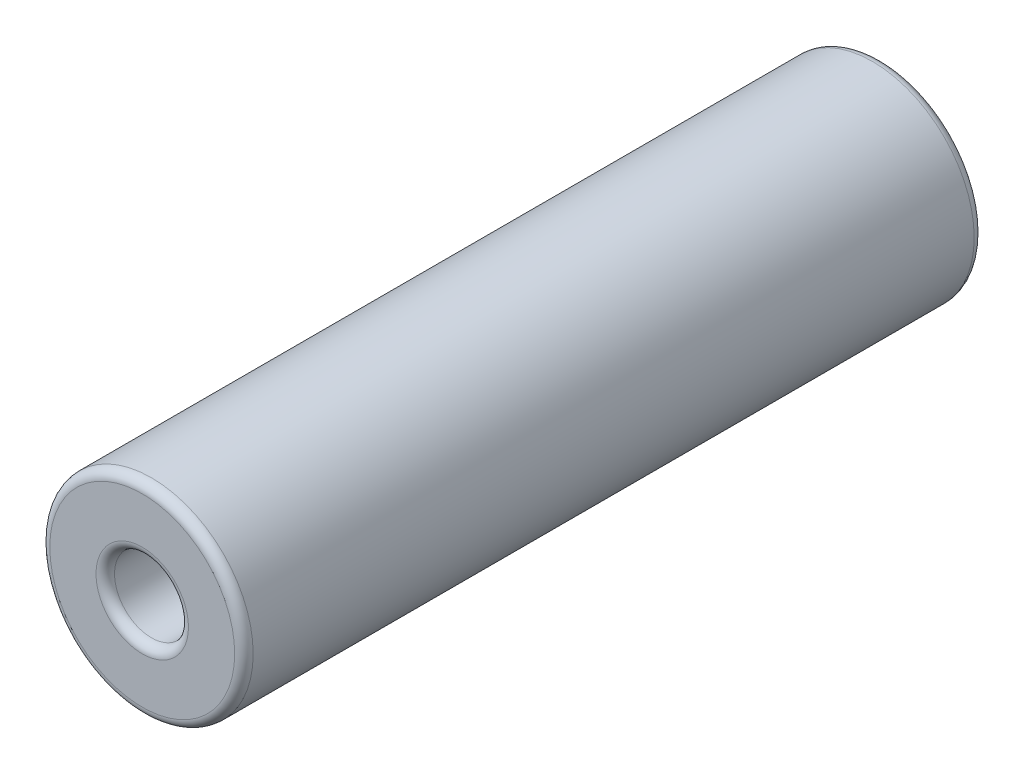
ISO-10303-21;
HEADER;
FILE_DESCRIPTION(('STEP AP214'),'2;1');
FILE_NAME('part.step','',(''),(''),'','','');
FILE_SCHEMA(('AUTOMOTIVE_DESIGN { 1 0 10303 214 1 1 1 1 }'));
ENDSEC;
DATA;
#1=APPLICATION_CONTEXT('core data for automotive mechanical design processes');
#2=APPLICATION_PROTOCOL_DEFINITION('international standard','automotive_design',2000,#1);
#3=PRODUCT_CONTEXT('',#1,'mechanical');
#4=PRODUCT('Part','Part','',(#3));
#5=PRODUCT_RELATED_PRODUCT_CATEGORY('part','',(#4));
#6=PRODUCT_DEFINITION_FORMATION('','',#4);
#7=PRODUCT_DEFINITION_CONTEXT('part definition',#1,'design');
#8=PRODUCT_DEFINITION('design','',#6,#7);
#9=PRODUCT_DEFINITION_SHAPE('','',#8);
#10=(LENGTH_UNIT() NAMED_UNIT(*) SI_UNIT(.MILLI.,.METRE.));
#11=(NAMED_UNIT(*) PLANE_ANGLE_UNIT() SI_UNIT($,.RADIAN.));
#12=(NAMED_UNIT(*) SI_UNIT($,.STERADIAN.) SOLID_ANGLE_UNIT());
#13=UNCERTAINTY_MEASURE_WITH_UNIT(LENGTH_MEASURE(1.E-05),#10,'distance_accuracy_value','');
#14=(GEOMETRIC_REPRESENTATION_CONTEXT(3) GLOBAL_UNCERTAINTY_ASSIGNED_CONTEXT((#13)) GLOBAL_UNIT_ASSIGNED_CONTEXT((#10,
#11,#12)) REPRESENTATION_CONTEXT('',''));
#15=CARTESIAN_POINT('',(0.,0.,0.));
#16=DIRECTION('',(0.,0.,1.));
#17=DIRECTION('',(1.,0.,0.));
#18=AXIS2_PLACEMENT_3D('',#15,#16,#17);
#19=CARTESIAN_POINT('',(0.,0.,40.));
#20=DIRECTION('',(0.,0.,-1.));
#21=DIRECTION('',(-1.,0.,0.));
#22=AXIS2_PLACEMENT_3D('',#19,#20,#21);
#23=CYLINDRICAL_SURFACE('',#22,5.5);
#24=CARTESIAN_POINT('',(0.,0.,0.5));
#25=DIRECTION('',(0.,0.,1.));
#26=DIRECTION('',(1.,0.,0.));
#27=AXIS2_PLACEMENT_3D('',#24,#25,#26);
#28=CIRCLE('',#27,5.5);
#29=CARTESIAN_POINT('',(5.5,0.,0.5));
#30=VERTEX_POINT('',#29);
#31=EDGE_CURVE('E70',#30,#30,#28,.T.);
#32=ORIENTED_EDGE('',*,*,#31,.T.);
#33=EDGE_LOOP('',(#32));
#34=FACE_BOUND('',#33,.T.);
#35=CARTESIAN_POINT('',(0.,0.,39.5));
#36=DIRECTION('',(0.,0.,1.));
#37=DIRECTION('',(1.,0.,0.));
#38=AXIS2_PLACEMENT_3D('',#35,#36,#37);
#39=CIRCLE('',#38,5.5);
#40=CARTESIAN_POINT('',(5.5,0.,39.5));
#41=VERTEX_POINT('',#40);
#42=EDGE_CURVE('E75',#41,#41,#39,.F.);
#43=ORIENTED_EDGE('',*,*,#42,.T.);
#44=EDGE_LOOP('',(#43));
#45=FACE_BOUND('',#44,.T.);
#46=ADVANCED_FACE('F45',(#34,#45),#23,.T.);
#47=CARTESIAN_POINT('',(0.,0.,40.));
#48=DIRECTION('',(0.,0.,1.));
#49=DIRECTION('',(1.,0.,0.));
#50=AXIS2_PLACEMENT_3D('',#47,#48,#49);
#51=PLANE('',#50);
#52=CARTESIAN_POINT('',(0.,0.,40.));
#53=DIRECTION('',(0.,0.,1.));
#54=DIRECTION('',(1.,0.,0.));
#55=AXIS2_PLACEMENT_3D('',#52,#53,#54);
#56=CIRCLE('',#55,5.);
#57=CARTESIAN_POINT('',(5.,0.,40.));
#58=VERTEX_POINT('',#57);
#59=EDGE_CURVE('E11',#58,#58,#56,.T.);
#60=ORIENTED_EDGE('',*,*,#59,.T.);
#61=EDGE_LOOP('',(#60));
#62=FACE_BOUND('',#61,.T.);
#63=CARTESIAN_POINT('',(0.,0.,40.));
#64=DIRECTION('',(0.,0.,1.));
#65=DIRECTION('',(1.,0.,0.));
#66=AXIS2_PLACEMENT_3D('',#63,#64,#65);
#67=CIRCLE('',#66,2.5);
#68=CARTESIAN_POINT('',(2.5,0.,40.));
#69=VERTEX_POINT('',#68);
#70=EDGE_CURVE('E52',#69,#69,#67,.F.);
#71=ORIENTED_EDGE('',*,*,#70,.T.);
#72=EDGE_LOOP('',(#71));
#73=FACE_BOUND('',#72,.T.);
#74=ADVANCED_FACE('F93',(#62,#73),#51,.T.);
#75=CARTESIAN_POINT('',(0.,0.,0.));
#76=DIRECTION('',(0.,0.,1.));
#77=DIRECTION('',(1.,0.,0.));
#78=AXIS2_PLACEMENT_3D('',#75,#76,#77);
#79=PLANE('',#78);
#80=CARTESIAN_POINT('',(0.,0.,0.));
#81=DIRECTION('',(0.,0.,1.));
#82=DIRECTION('',(1.,0.,0.));
#83=AXIS2_PLACEMENT_3D('',#80,#81,#82);
#84=CIRCLE('',#83,5.);
#85=CARTESIAN_POINT('',(5.,0.,0.));
#86=VERTEX_POINT('',#85);
#87=EDGE_CURVE('E65',#86,#86,#84,.F.);
#88=ORIENTED_EDGE('',*,*,#87,.T.);
#89=EDGE_LOOP('',(#88));
#90=FACE_BOUND('',#89,.T.);
#91=CARTESIAN_POINT('',(0.,0.,0.));
#92=DIRECTION('',(0.,0.,1.));
#93=DIRECTION('',(1.,0.,0.));
#94=AXIS2_PLACEMENT_3D('',#91,#92,#93);
#95=CIRCLE('',#94,2.5);
#96=CARTESIAN_POINT('',(2.5,0.,0.));
#97=VERTEX_POINT('',#96);
#98=EDGE_CURVE('E68',#97,#97,#95,.T.);
#99=ORIENTED_EDGE('',*,*,#98,.T.);
#100=EDGE_LOOP('',(#99));
#101=FACE_BOUND('',#100,.T.);
#102=ADVANCED_FACE('F99',(#90,#101),#79,.F.);
#103=CARTESIAN_POINT('',(0.,0.,0.));
#104=DIRECTION('',(0.,0.,1.));
#105=DIRECTION('',(1.,0.,0.));
#106=AXIS2_PLACEMENT_3D('',#103,#104,#105);
#107=CYLINDRICAL_SURFACE('',#106,2.);
#108=CARTESIAN_POINT('',(0.,0.,0.5));
#109=DIRECTION('',(0.,0.,1.));
#110=DIRECTION('',(1.,0.,0.));
#111=AXIS2_PLACEMENT_3D('',#108,#109,#110);
#112=CIRCLE('',#111,2.);
#113=CARTESIAN_POINT('',(2.,0.,0.5));
#114=VERTEX_POINT('',#113);
#115=EDGE_CURVE('E56',#114,#114,#112,.F.);
#116=ORIENTED_EDGE('',*,*,#115,.T.);
#117=EDGE_LOOP('',(#116));
#118=FACE_BOUND('',#117,.T.);
#119=CARTESIAN_POINT('',(0.,0.,39.5));
#120=DIRECTION('',(0.,0.,1.));
#121=DIRECTION('',(1.,0.,0.));
#122=AXIS2_PLACEMENT_3D('',#119,#120,#121);
#123=CIRCLE('',#122,2.);
#124=CARTESIAN_POINT('',(2.,0.,39.5));
#125=VERTEX_POINT('',#124);
#126=EDGE_CURVE('E60',#125,#125,#123,.T.);
#127=ORIENTED_EDGE('',*,*,#126,.T.);
#128=EDGE_LOOP('',(#127));
#129=FACE_BOUND('',#128,.T.);
#130=ADVANCED_FACE('F105',(#118,#129),#107,.F.);
#131=CARTESIAN_POINT('',(0.,0.,0.5));
#132=DIRECTION('',(0.,0.,1.));
#133=DIRECTION('',(1.,0.,0.));
#134=AXIS2_PLACEMENT_3D('',#131,#132,#133);
#135=TOROIDAL_SURFACE('',#134,5.,0.5);
#136=ORIENTED_EDGE('',*,*,#87,.F.);
#137=EDGE_LOOP('',(#136));
#138=FACE_BOUND('',#137,.T.);
#139=ORIENTED_EDGE('',*,*,#31,.F.);
#140=EDGE_LOOP('',(#139));
#141=FACE_BOUND('',#140,.T.);
#142=ADVANCED_FACE('F89',(#138,#141),#135,.T.);
#143=CARTESIAN_POINT('',(0.,0.,0.5));
#144=DIRECTION('',(0.,0.,1.));
#145=DIRECTION('',(1.,0.,0.));
#146=AXIS2_PLACEMENT_3D('',#143,#144,#145);
#147=TOROIDAL_SURFACE('',#146,2.5,0.5);
#148=ORIENTED_EDGE('',*,*,#115,.F.);
#149=EDGE_LOOP('',(#148));
#150=FACE_BOUND('',#149,.T.);
#151=ORIENTED_EDGE('',*,*,#98,.F.);
#152=EDGE_LOOP('',(#151));
#153=FACE_BOUND('',#152,.T.);
#154=ADVANCED_FACE('F83',(#150,#153),#147,.T.);
#155=CARTESIAN_POINT('',(0.,0.,39.5));
#156=DIRECTION('',(0.,0.,1.));
#157=DIRECTION('',(1.,0.,0.));
#158=AXIS2_PLACEMENT_3D('',#155,#156,#157);
#159=TOROIDAL_SURFACE('',#158,5.,0.5);
#160=ORIENTED_EDGE('',*,*,#42,.F.);
#161=EDGE_LOOP('',(#160));
#162=FACE_BOUND('',#161,.T.);
#163=ORIENTED_EDGE('',*,*,#59,.F.);
#164=EDGE_LOOP('',(#163));
#165=FACE_BOUND('',#164,.T.);
#166=ADVANCED_FACE('F80',(#162,#165),#159,.T.);
#167=CARTESIAN_POINT('',(0.,0.,39.5));
#168=DIRECTION('',(0.,0.,1.));
#169=DIRECTION('',(1.,0.,0.));
#170=AXIS2_PLACEMENT_3D('',#167,#168,#169);
#171=TOROIDAL_SURFACE('',#170,2.5,0.5);
#172=ORIENTED_EDGE('',*,*,#70,.F.);
#173=EDGE_LOOP('',(#172));
#174=FACE_BOUND('',#173,.T.);
#175=ORIENTED_EDGE('',*,*,#126,.F.);
#176=EDGE_LOOP('',(#175));
#177=FACE_BOUND('',#176,.T.);
#178=ADVANCED_FACE('F47',(#174,#177),#171,.T.);
#179=CLOSED_SHELL('',(#46,#74,#102,#130,#142,#154,#166,#178));
#180=MANIFOLD_SOLID_BREP('B2',#179);
#181=ADVANCED_BREP_SHAPE_REPRESENTATION('',(#18,#180),#14);
#182=SHAPE_DEFINITION_REPRESENTATION(#9,#181);
ENDSEC;
END-ISO-10303-21;
